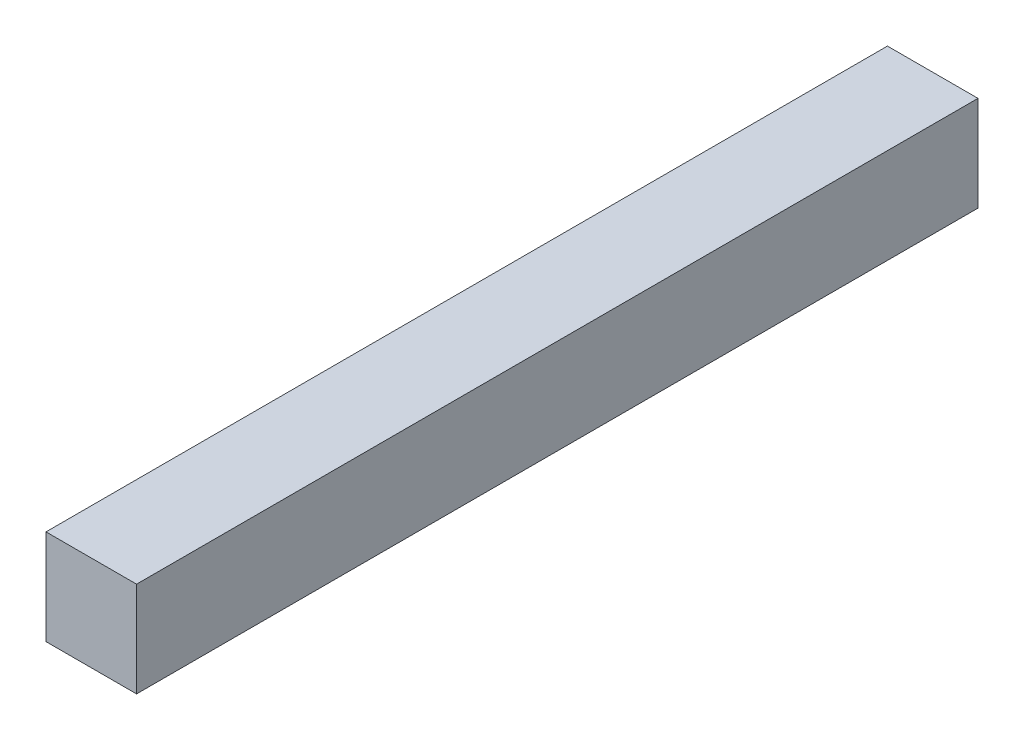
ISO-10303-21;
HEADER;
FILE_DESCRIPTION(('STEP AP214'),'2;1');
FILE_NAME('part.step','',(''),(''),'','','');
FILE_SCHEMA(('AUTOMOTIVE_DESIGN { 1 0 10303 214 1 1 1 1 }'));
ENDSEC;
DATA;
#1=APPLICATION_CONTEXT('core data for automotive mechanical design processes');
#2=APPLICATION_PROTOCOL_DEFINITION('international standard','automotive_design',2000,#1);
#3=PRODUCT_CONTEXT('',#1,'mechanical');
#4=PRODUCT('Part','Part','',(#3));
#5=PRODUCT_RELATED_PRODUCT_CATEGORY('part','',(#4));
#6=PRODUCT_DEFINITION_FORMATION('','',#4);
#7=PRODUCT_DEFINITION_CONTEXT('part definition',#1,'design');
#8=PRODUCT_DEFINITION('design','',#6,#7);
#9=PRODUCT_DEFINITION_SHAPE('','',#8);
#10=(LENGTH_UNIT() NAMED_UNIT(*) SI_UNIT(.MILLI.,.METRE.));
#11=(NAMED_UNIT(*) PLANE_ANGLE_UNIT() SI_UNIT($,.RADIAN.));
#12=(NAMED_UNIT(*) SI_UNIT($,.STERADIAN.) SOLID_ANGLE_UNIT());
#13=UNCERTAINTY_MEASURE_WITH_UNIT(LENGTH_MEASURE(1.E-05),#10,'distance_accuracy_value','');
#14=(GEOMETRIC_REPRESENTATION_CONTEXT(3) GLOBAL_UNCERTAINTY_ASSIGNED_CONTEXT((#13)) GLOBAL_UNIT_ASSIGNED_CONTEXT((#10,
#11,#12)) REPRESENTATION_CONTEXT('',''));
#15=CARTESIAN_POINT('',(0.,0.,0.));
#16=DIRECTION('',(0.,0.,1.));
#17=DIRECTION('',(1.,0.,0.));
#18=AXIS2_PLACEMENT_3D('',#15,#16,#17);
#19=CARTESIAN_POINT('',(0.1905,0.1999996,3.54000054));
#20=DIRECTION('',(0.,0.,-1.));
#21=DIRECTION('',(0.,-1.,0.));
#22=AXIS2_PLACEMENT_3D('',#19,#20,#21);
#23=PLANE('',#22);
#24=DIRECTION('',(-1.,0.,0.));
#25=VECTOR('',#24,1.);
#26=CARTESIAN_POINT('',(0.1905,0.1999996,3.54000054));
#27=LINE('',#26,#25);
#28=CARTESIAN_POINT('',(0.1905,0.1999996,3.54000054));
#29=VERTEX_POINT('',#28);
#30=CARTESIAN_POINT('',(-0.1905,0.1999996,3.54000054));
#31=VERTEX_POINT('',#30);
#32=EDGE_CURVE('E82',#29,#31,#27,.T.);
#33=ORIENTED_EDGE('',*,*,#32,.T.);
#34=DIRECTION('',(0.,-1.,0.));
#35=VECTOR('',#34,1.);
#36=CARTESIAN_POINT('',(-0.1905,0.1999996,3.54000054));
#37=LINE('',#36,#35);
#38=CARTESIAN_POINT('',(-0.1905,-0.1999996,3.54000054));
#39=VERTEX_POINT('',#38);
#40=EDGE_CURVE('E108',#31,#39,#37,.T.);
#41=ORIENTED_EDGE('',*,*,#40,.T.);
#42=DIRECTION('',(1.,0.,0.));
#43=VECTOR('',#42,1.);
#44=CARTESIAN_POINT('',(-0.1905,-0.1999996,3.54000054));
#45=LINE('',#44,#43);
#46=CARTESIAN_POINT('',(0.1905,-0.1999996,3.54000054));
#47=VERTEX_POINT('',#46);
#48=EDGE_CURVE('E74',#39,#47,#45,.T.);
#49=ORIENTED_EDGE('',*,*,#48,.T.);
#50=DIRECTION('',(0.,1.,0.));
#51=VECTOR('',#50,1.);
#52=CARTESIAN_POINT('',(0.1905,-0.1999996,3.54000054));
#53=LINE('',#52,#51);
#54=EDGE_CURVE('E11',#47,#29,#53,.T.);
#55=ORIENTED_EDGE('',*,*,#54,.T.);
#56=EDGE_LOOP('',(#33,#41,#49,#55));
#57=FACE_BOUND('',#56,.T.);
#58=ADVANCED_FACE('F17',(#57),#23,.F.);
#59=CARTESIAN_POINT('',(0.1905,0.1999996,0.));
#60=DIRECTION('',(0.,0.,-1.));
#61=DIRECTION('',(0.,-1.,0.));
#62=AXIS2_PLACEMENT_3D('',#59,#60,#61);
#63=PLANE('',#62);
#64=DIRECTION('',(0.,1.,0.));
#65=VECTOR('',#64,1.);
#66=CARTESIAN_POINT('',(0.1905,-0.1999996,0.));
#67=LINE('',#66,#65);
#68=CARTESIAN_POINT('',(0.1905,-0.1999996,0.));
#69=VERTEX_POINT('',#68);
#70=CARTESIAN_POINT('',(0.1905,0.1999996,0.));
#71=VERTEX_POINT('',#70);
#72=EDGE_CURVE('E25',#69,#71,#67,.T.);
#73=ORIENTED_EDGE('',*,*,#72,.F.);
#74=DIRECTION('',(1.,0.,0.));
#75=VECTOR('',#74,1.);
#76=CARTESIAN_POINT('',(-0.1905,-0.1999996,0.));
#77=LINE('',#76,#75);
#78=CARTESIAN_POINT('',(-0.1905,-0.1999996,0.));
#79=VERTEX_POINT('',#78);
#80=EDGE_CURVE('E112',#79,#69,#77,.T.);
#81=ORIENTED_EDGE('',*,*,#80,.F.);
#82=DIRECTION('',(0.,-1.,0.));
#83=VECTOR('',#82,1.);
#84=CARTESIAN_POINT('',(-0.1905,0.1999996,0.));
#85=LINE('',#84,#83);
#86=CARTESIAN_POINT('',(-0.1905,0.1999996,0.));
#87=VERTEX_POINT('',#86);
#88=EDGE_CURVE('E84',#87,#79,#85,.T.);
#89=ORIENTED_EDGE('',*,*,#88,.F.);
#90=DIRECTION('',(-1.,0.,0.));
#91=VECTOR('',#90,1.);
#92=CARTESIAN_POINT('',(0.1905,0.1999996,0.));
#93=LINE('',#92,#91);
#94=EDGE_CURVE('E80',#71,#87,#93,.T.);
#95=ORIENTED_EDGE('',*,*,#94,.F.);
#96=EDGE_LOOP('',(#73,#81,#89,#95));
#97=FACE_BOUND('',#96,.T.);
#98=ADVANCED_FACE('F86',(#97),#63,.T.);
#99=CARTESIAN_POINT('',(0.1905,-0.1999996,0.));
#100=DIRECTION('',(-1.,0.,0.));
#101=DIRECTION('',(0.,0.,1.));
#102=AXIS2_PLACEMENT_3D('',#99,#100,#101);
#103=PLANE('',#102);
#104=ORIENTED_EDGE('',*,*,#72,.T.);
#105=DIRECTION('',(0.,0.,1.));
#106=VECTOR('',#105,1.);
#107=CARTESIAN_POINT('',(0.1905,0.1999996,0.));
#108=LINE('',#107,#106);
#109=EDGE_CURVE('E68',#71,#29,#108,.T.);
#110=ORIENTED_EDGE('',*,*,#109,.T.);
#111=ORIENTED_EDGE('',*,*,#54,.F.);
#112=DIRECTION('',(0.,0.,1.));
#113=VECTOR('',#112,1.);
#114=CARTESIAN_POINT('',(0.1905,-0.1999996,0.));
#115=LINE('',#114,#113);
#116=EDGE_CURVE('E71',#69,#47,#115,.T.);
#117=ORIENTED_EDGE('',*,*,#116,.F.);
#118=EDGE_LOOP('',(#104,#110,#111,#117));
#119=FACE_BOUND('',#118,.T.);
#120=ADVANCED_FACE('F67',(#119),#103,.F.);
#121=CARTESIAN_POINT('',(-0.1905,-0.1999996,0.));
#122=DIRECTION('',(0.,1.,0.));
#123=DIRECTION('',(1.,0.,0.));
#124=AXIS2_PLACEMENT_3D('',#121,#122,#123);
#125=PLANE('',#124);
#126=ORIENTED_EDGE('',*,*,#80,.T.);
#127=ORIENTED_EDGE('',*,*,#116,.T.);
#128=ORIENTED_EDGE('',*,*,#48,.F.);
#129=DIRECTION('',(0.,0.,1.));
#130=VECTOR('',#129,1.);
#131=CARTESIAN_POINT('',(-0.1905,-0.1999996,0.));
#132=LINE('',#131,#130);
#133=EDGE_CURVE('E102',#79,#39,#132,.T.);
#134=ORIENTED_EDGE('',*,*,#133,.F.);
#135=EDGE_LOOP('',(#126,#127,#128,#134));
#136=FACE_BOUND('',#135,.T.);
#137=ADVANCED_FACE('F118',(#136),#125,.F.);
#138=CARTESIAN_POINT('',(-0.1905,0.1999996,0.));
#139=DIRECTION('',(1.,0.,0.));
#140=DIRECTION('',(0.,1.,0.));
#141=AXIS2_PLACEMENT_3D('',#138,#139,#140);
#142=PLANE('',#141);
#143=ORIENTED_EDGE('',*,*,#88,.T.);
#144=ORIENTED_EDGE('',*,*,#133,.T.);
#145=ORIENTED_EDGE('',*,*,#40,.F.);
#146=DIRECTION('',(0.,0.,1.));
#147=VECTOR('',#146,1.);
#148=CARTESIAN_POINT('',(-0.1905,0.1999996,0.));
#149=LINE('',#148,#147);
#150=EDGE_CURVE('E90',#87,#31,#149,.T.);
#151=ORIENTED_EDGE('',*,*,#150,.F.);
#152=EDGE_LOOP('',(#143,#144,#145,#151));
#153=FACE_BOUND('',#152,.T.);
#154=ADVANCED_FACE('F121',(#153),#142,.F.);
#155=CARTESIAN_POINT('',(0.1905,0.1999996,0.));
#156=DIRECTION('',(0.,-1.,0.));
#157=DIRECTION('',(0.,0.,-1.));
#158=AXIS2_PLACEMENT_3D('',#155,#156,#157);
#159=PLANE('',#158);
#160=ORIENTED_EDGE('',*,*,#94,.T.);
#161=ORIENTED_EDGE('',*,*,#150,.T.);
#162=ORIENTED_EDGE('',*,*,#32,.F.);
#163=ORIENTED_EDGE('',*,*,#109,.F.);
#164=EDGE_LOOP('',(#160,#161,#162,#163));
#165=FACE_BOUND('',#164,.T.);
#166=ADVANCED_FACE('F78',(#165),#159,.F.);
#167=CLOSED_SHELL('',(#58,#98,#120,#137,#154,#166));
#168=MANIFOLD_SOLID_BREP('B1',#167);
#169=ADVANCED_BREP_SHAPE_REPRESENTATION('',(#18,#168),#14);
#170=SHAPE_DEFINITION_REPRESENTATION(#9,#169);
ENDSEC;
END-ISO-10303-21;
